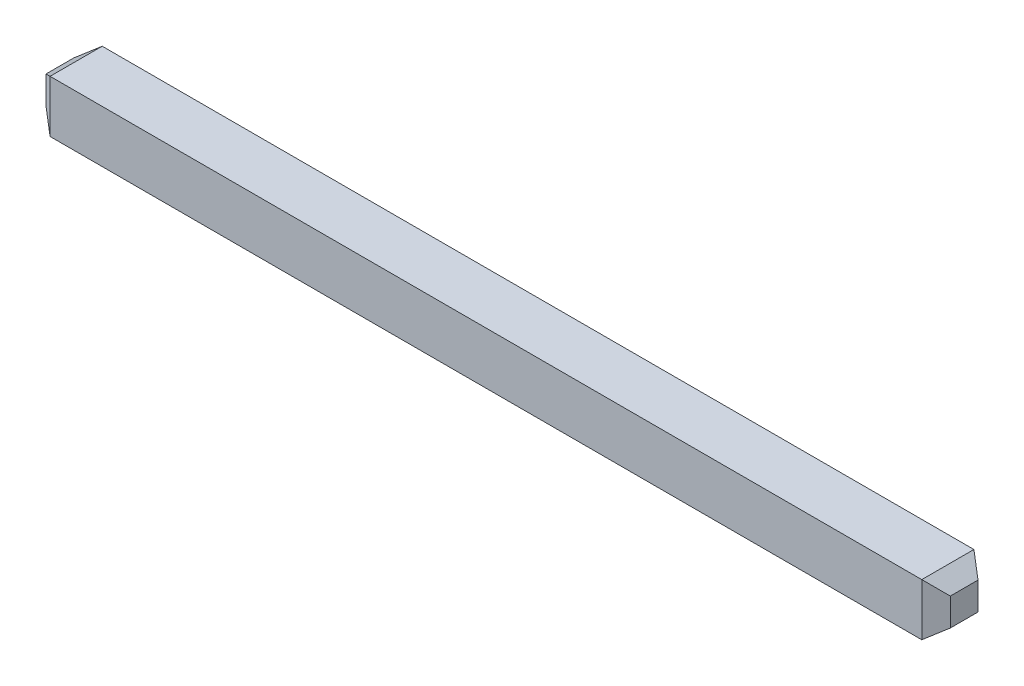
ISO-10303-21;
HEADER;
FILE_DESCRIPTION(('STEP AP214'),'2;1');
FILE_NAME('part.step','',(''),(''),'','','');
FILE_SCHEMA(('AUTOMOTIVE_DESIGN { 1 0 10303 214 1 1 1 1 }'));
ENDSEC;
DATA;
#1=APPLICATION_CONTEXT('core data for automotive mechanical design processes');
#2=APPLICATION_PROTOCOL_DEFINITION('international standard','automotive_design',2000,#1);
#3=PRODUCT_CONTEXT('',#1,'mechanical');
#4=PRODUCT('Part','Part','',(#3));
#5=PRODUCT_RELATED_PRODUCT_CATEGORY('part','',(#4));
#6=PRODUCT_DEFINITION_FORMATION('','',#4);
#7=PRODUCT_DEFINITION_CONTEXT('part definition',#1,'design');
#8=PRODUCT_DEFINITION('design','',#6,#7);
#9=PRODUCT_DEFINITION_SHAPE('','',#8);
#10=(LENGTH_UNIT() NAMED_UNIT(*) SI_UNIT(.MILLI.,.METRE.));
#11=(NAMED_UNIT(*) PLANE_ANGLE_UNIT() SI_UNIT($,.RADIAN.));
#12=(NAMED_UNIT(*) SI_UNIT($,.STERADIAN.) SOLID_ANGLE_UNIT());
#13=UNCERTAINTY_MEASURE_WITH_UNIT(LENGTH_MEASURE(1.E-05),#10,'distance_accuracy_value','');
#14=(GEOMETRIC_REPRESENTATION_CONTEXT(3) GLOBAL_UNCERTAINTY_ASSIGNED_CONTEXT((#13)) GLOBAL_UNIT_ASSIGNED_CONTEXT((#10,
#11,#12)) REPRESENTATION_CONTEXT('',''));
#15=CARTESIAN_POINT('',(0.,0.,0.));
#16=DIRECTION('',(0.,0.,1.));
#17=DIRECTION('',(1.,0.,0.));
#18=AXIS2_PLACEMENT_3D('',#15,#16,#17);
#19=CARTESIAN_POINT('',(-2.4,1.23,-44.695));
#20=DIRECTION('',(0.599999999990736,0.,0.800000000006948));
#21=DIRECTION('',(0.800000000006948,0.,-0.599999999990736));
#22=AXIS2_PLACEMENT_3D('',#19,#20,#21);
#23=PLANE('',#22);
#24=DIRECTION('',(0.,1.,0.));
#25=VECTOR('',#24,1.);
#26=CARTESIAN_POINT('',(-2.3,1.23,-44.77));
#27=LINE('',#26,#25);
#28=CARTESIAN_POINT('',(-2.29999999999956,1.55,-44.7699999999994));
#29=VERTEX_POINT('',#28);
#30=CARTESIAN_POINT('',(-2.29999999999957,0.909999999999898,-44.7699999999994));
#31=VERTEX_POINT('',#30);
#32=EDGE_CURVE('E101',#29,#31,#27,.F.);
#33=ORIENTED_EDGE('',*,*,#32,.T.);
#34=DIRECTION('',(-0.685994340569487,0.514495755428337,0.514495755427447));
#35=VECTOR('',#34,1.);
#36=CARTESIAN_POINT('',(-2.30000000000009,0.909999999999786,-44.77));
#37=LINE('',#36,#35);
#38=CARTESIAN_POINT('',(-2.50000000000021,1.06000000000001,-44.6200000000003));
#39=VERTEX_POINT('',#38);
#40=EDGE_CURVE('E85',#31,#39,#37,.T.);
#41=ORIENTED_EDGE('',*,*,#40,.T.);
#42=DIRECTION('',(0.,1.,0.));
#43=VECTOR('',#42,1.);
#44=CARTESIAN_POINT('',(-2.5,1.23,-44.62));
#45=LINE('',#44,#43);
#46=CARTESIAN_POINT('',(-2.50000000000043,1.4,-44.6200000000006));
#47=VERTEX_POINT('',#46);
#48=EDGE_CURVE('E79',#39,#47,#45,.T.);
#49=ORIENTED_EDGE('',*,*,#48,.T.);
#50=DIRECTION('',(-0.68599434057003,-0.514495755427523,0.514495755427537));
#51=VECTOR('',#50,1.);
#52=CARTESIAN_POINT('',(-2.3,1.55,-44.77));
#53=LINE('',#52,#51);
#54=EDGE_CURVE('E20',#29,#47,#53,.T.);
#55=ORIENTED_EDGE('',*,*,#54,.F.);
#56=EDGE_LOOP('',(#33,#41,#49,#55));
#57=FACE_BOUND('',#56,.T.);
#58=ADVANCED_FACE('F17',(#57),#23,.F.);
#59=CARTESIAN_POINT('',(8.5,1.23,-44.695));
#60=DIRECTION('',(-0.599999999990736,0.,0.800000000006948));
#61=DIRECTION('',(0.800000000006948,0.,0.599999999990736));
#62=AXIS2_PLACEMENT_3D('',#59,#60,#61);
#63=PLANE('',#62);
#64=DIRECTION('',(0.,1.,0.));
#65=VECTOR('',#64,1.);
#66=CARTESIAN_POINT('',(8.6,1.23,-44.62));
#67=LINE('',#66,#65);
#68=CARTESIAN_POINT('',(8.6000000000002,1.06000000000003,-44.6200000000003));
#69=VERTEX_POINT('',#68);
#70=CARTESIAN_POINT('',(8.60000000000043,1.4,-44.6200000000006));
#71=VERTEX_POINT('',#70);
#72=EDGE_CURVE('E113',#69,#71,#67,.T.);
#73=ORIENTED_EDGE('',*,*,#72,.F.);
#74=DIRECTION('',(-0.685994340569488,-0.514495755428337,-0.514495755427446));
#75=VECTOR('',#74,1.);
#76=CARTESIAN_POINT('',(8.59999999999996,1.06000000000005,-44.62));
#77=LINE('',#76,#75);
#78=CARTESIAN_POINT('',(8.39999999999958,0.909999999999884,-44.7699999999994));
#79=VERTEX_POINT('',#78);
#80=EDGE_CURVE('E108',#69,#79,#77,.T.);
#81=ORIENTED_EDGE('',*,*,#80,.T.);
#82=DIRECTION('',(0.,1.,0.));
#83=VECTOR('',#82,1.);
#84=CARTESIAN_POINT('',(8.4,1.23,-44.77));
#85=LINE('',#84,#83);
#86=CARTESIAN_POINT('',(8.39999999999956,1.55,-44.7699999999994));
#87=VERTEX_POINT('',#86);
#88=EDGE_CURVE('E99',#79,#87,#85,.T.);
#89=ORIENTED_EDGE('',*,*,#88,.T.);
#90=DIRECTION('',(-0.685994340570029,0.514495755427522,-0.51449575542754));
#91=VECTOR('',#90,1.);
#92=CARTESIAN_POINT('',(8.6,1.4,-44.62));
#93=LINE('',#92,#91);
#94=EDGE_CURVE('E116',#71,#87,#93,.T.);
#95=ORIENTED_EDGE('',*,*,#94,.F.);
#96=EDGE_LOOP('',(#73,#81,#89,#95));
#97=FACE_BOUND('',#96,.T.);
#98=ADVANCED_FACE('F214',(#97),#63,.F.);
#99=CARTESIAN_POINT('',(-2.4,1.475,-44.45));
#100=DIRECTION('',(-0.6,0.8,0.));
#101=DIRECTION('',(-0.8,-0.6,0.));
#102=AXIS2_PLACEMENT_3D('',#99,#100,#101);
#103=PLANE('',#102);
#104=DIRECTION('',(-0.685994340575993,-0.514495755427534,-0.514495755419575));
#105=VECTOR('',#104,1.);
#106=CARTESIAN_POINT('',(-2.29999999999913,1.55,-44.1300000000012));
#107=LINE('',#106,#105);
#108=CARTESIAN_POINT('',(-2.29999999999989,1.55,-44.1300000000002));
#109=VERTEX_POINT('',#108);
#110=CARTESIAN_POINT('',(-2.50000000000022,1.4,-44.2799999999997));
#111=VERTEX_POINT('',#110);
#112=EDGE_CURVE('E128',#109,#111,#107,.T.);
#113=ORIENTED_EDGE('',*,*,#112,.F.);
#114=DIRECTION('',(0.,0.,1.));
#115=VECTOR('',#114,1.);
#116=CARTESIAN_POINT('',(-2.3,1.55,-44.45));
#117=LINE('',#116,#115);
#118=EDGE_CURVE('E93',#29,#109,#117,.T.);
#119=ORIENTED_EDGE('',*,*,#118,.F.);
#120=ORIENTED_EDGE('',*,*,#54,.T.);
#121=DIRECTION('',(0.,0.,-1.));
#122=VECTOR('',#121,1.);
#123=CARTESIAN_POINT('',(-2.5,1.4,-44.45));
#124=LINE('',#123,#122);
#125=EDGE_CURVE('E87',#47,#111,#124,.F.);
#126=ORIENTED_EDGE('',*,*,#125,.T.);
#127=EDGE_LOOP('',(#113,#119,#120,#126));
#128=FACE_BOUND('',#127,.T.);
#129=ADVANCED_FACE('F90',(#128),#103,.T.);
#130=CARTESIAN_POINT('',(-2.5,1.23,-44.45));
#131=DIRECTION('',(1.,0.,0.));
#132=DIRECTION('',(0.,0.,-1.));
#133=AXIS2_PLACEMENT_3D('',#130,#131,#132);
#134=PLANE('',#133);
#135=DIRECTION('',(0.,1.,0.));
#136=VECTOR('',#135,1.);
#137=CARTESIAN_POINT('',(-2.50000000000087,1.23,-44.2799999999988));
#138=LINE('',#137,#136);
#139=CARTESIAN_POINT('',(-2.50000000000021,1.06000000000001,-44.2799999999997));
#140=VERTEX_POINT('',#139);
#141=EDGE_CURVE('E97',#111,#140,#138,.F.);
#142=ORIENTED_EDGE('',*,*,#141,.F.);
#143=ORIENTED_EDGE('',*,*,#125,.F.);
#144=ORIENTED_EDGE('',*,*,#48,.F.);
#145=DIRECTION('',(0.,0.,1.));
#146=VECTOR('',#145,1.);
#147=CARTESIAN_POINT('',(-2.49999999999996,1.06000000000005,-44.45));
#148=LINE('',#147,#146);
#149=EDGE_CURVE('E105',#39,#140,#148,.T.);
#150=ORIENTED_EDGE('',*,*,#149,.T.);
#151=EDGE_LOOP('',(#142,#143,#144,#150));
#152=FACE_BOUND('',#151,.T.);
#153=ADVANCED_FACE('F95',(#152),#134,.F.);
#154=CARTESIAN_POINT('',(3.05,1.23,-44.77));
#155=DIRECTION('',(0.,0.,1.));
#156=DIRECTION('',(1.,0.,0.));
#157=AXIS2_PLACEMENT_3D('',#154,#155,#156);
#158=PLANE('',#157);
#159=ORIENTED_EDGE('',*,*,#32,.F.);
#160=DIRECTION('',(1.,0.,0.));
#161=VECTOR('',#160,1.);
#162=CARTESIAN_POINT('',(3.05,1.55,-44.77));
#163=LINE('',#162,#161);
#164=EDGE_CURVE('E122',#87,#29,#163,.F.);
#165=ORIENTED_EDGE('',*,*,#164,.F.);
#166=ORIENTED_EDGE('',*,*,#88,.F.);
#167=DIRECTION('',(1.,0.,0.));
#168=VECTOR('',#167,1.);
#169=CARTESIAN_POINT('',(3.05,0.91,-44.77));
#170=LINE('',#169,#168);
#171=EDGE_CURVE('E136',#79,#31,#170,.F.);
#172=ORIENTED_EDGE('',*,*,#171,.T.);
#173=EDGE_LOOP('',(#159,#165,#166,#172));
#174=FACE_BOUND('',#173,.T.);
#175=ADVANCED_FACE('F182',(#174),#158,.F.);
#176=CARTESIAN_POINT('',(-2.4,0.9849999999999,-44.45));
#177=DIRECTION('',(0.600000000000912,0.799999999999316,0.));
#178=DIRECTION('',(-0.799999999999316,0.600000000000912,0.));
#179=AXIS2_PLACEMENT_3D('',#176,#177,#178);
#180=PLANE('',#179);
#181=DIRECTION('',(0.,0.,1.));
#182=VECTOR('',#181,1.);
#183=CARTESIAN_POINT('',(-2.3,0.91,-44.45));
#184=LINE('',#183,#182);
#185=CARTESIAN_POINT('',(-2.29999999999983,0.909999999999856,-44.1300000000003));
#186=VERTEX_POINT('',#185);
#187=EDGE_CURVE('E139',#31,#186,#184,.T.);
#188=ORIENTED_EDGE('',*,*,#187,.T.);
#189=DIRECTION('',(0.685994340575871,-0.514495755427787,0.514495755419485));
#190=VECTOR('',#189,1.);
#191=CARTESIAN_POINT('',(-2.50000000000087,1.06,-44.2799999999988));
#192=LINE('',#191,#190);
#193=EDGE_CURVE('E131',#140,#186,#192,.T.);
#194=ORIENTED_EDGE('',*,*,#193,.F.);
#195=ORIENTED_EDGE('',*,*,#149,.F.);
#196=ORIENTED_EDGE('',*,*,#40,.F.);
#197=EDGE_LOOP('',(#188,#194,#195,#196));
#198=FACE_BOUND('',#197,.T.);
#199=ADVANCED_FACE('F179',(#198),#180,.F.);
#200=CARTESIAN_POINT('',(8.5,0.9849999999999,-44.45));
#201=DIRECTION('',(-0.600000000000912,0.799999999999316,0.));
#202=DIRECTION('',(-0.799999999999316,-0.600000000000912,0.));
#203=AXIS2_PLACEMENT_3D('',#200,#201,#202);
#204=PLANE('',#203);
#205=DIRECTION('',(0.,0.,-1.));
#206=VECTOR('',#205,1.);
#207=CARTESIAN_POINT('',(8.6,1.06,-44.45));
#208=LINE('',#207,#206);
#209=CARTESIAN_POINT('',(8.6000000000002,1.06000000000003,-44.2799999999997));
#210=VERTEX_POINT('',#209);
#211=EDGE_CURVE('E110',#210,#69,#208,.T.);
#212=ORIENTED_EDGE('',*,*,#211,.F.);
#213=DIRECTION('',(0.685994340575871,0.514495755427787,-0.514495755419485));
#214=VECTOR('',#213,1.);
#215=CARTESIAN_POINT('',(8.39999999999913,0.9099999999999,-44.1300000000012));
#216=LINE('',#215,#214);
#217=CARTESIAN_POINT('',(8.39999999999993,0.909999999999868,-44.1300000000002));
#218=VERTEX_POINT('',#217);
#219=EDGE_CURVE('E35',#218,#210,#216,.T.);
#220=ORIENTED_EDGE('',*,*,#219,.F.);
#221=DIRECTION('',(0.,0.,1.));
#222=VECTOR('',#221,1.);
#223=CARTESIAN_POINT('',(8.4,0.91,-44.45));
#224=LINE('',#223,#222);
#225=EDGE_CURVE('E134',#218,#79,#224,.F.);
#226=ORIENTED_EDGE('',*,*,#225,.T.);
#227=ORIENTED_EDGE('',*,*,#80,.F.);
#228=EDGE_LOOP('',(#212,#220,#226,#227));
#229=FACE_BOUND('',#228,.T.);
#230=ADVANCED_FACE('F181',(#229),#204,.F.);
#231=CARTESIAN_POINT('',(8.6,1.23,-44.45));
#232=DIRECTION('',(1.,0.,0.));
#233=DIRECTION('',(0.,0.,-1.));
#234=AXIS2_PLACEMENT_3D('',#231,#232,#233);
#235=PLANE('',#234);
#236=ORIENTED_EDGE('',*,*,#72,.T.);
#237=DIRECTION('',(0.,0.,1.));
#238=VECTOR('',#237,1.);
#239=CARTESIAN_POINT('',(8.6,1.4,-44.45));
#240=LINE('',#239,#238);
#241=CARTESIAN_POINT('',(8.60000000000022,1.4,-44.2799999999997));
#242=VERTEX_POINT('',#241);
#243=EDGE_CURVE('E119',#242,#71,#240,.F.);
#244=ORIENTED_EDGE('',*,*,#243,.F.);
#245=DIRECTION('',(0.,1.,0.));
#246=VECTOR('',#245,1.);
#247=CARTESIAN_POINT('',(8.60000000000087,1.23,-44.2799999999988));
#248=LINE('',#247,#246);
#249=EDGE_CURVE('E142',#210,#242,#248,.T.);
#250=ORIENTED_EDGE('',*,*,#249,.F.);
#251=ORIENTED_EDGE('',*,*,#211,.T.);
#252=EDGE_LOOP('',(#236,#244,#250,#251));
#253=FACE_BOUND('',#252,.T.);
#254=ADVANCED_FACE('F189',(#253),#235,.T.);
#255=CARTESIAN_POINT('',(8.5,1.475,-44.45));
#256=DIRECTION('',(0.6,0.8,0.));
#257=DIRECTION('',(-0.8,0.6,0.));
#258=AXIS2_PLACEMENT_3D('',#255,#256,#257);
#259=PLANE('',#258);
#260=DIRECTION('',(-0.685994340575992,0.514495755427535,0.514495755419576));
#261=VECTOR('',#260,1.);
#262=CARTESIAN_POINT('',(8.60000000000087,1.4,-44.2799999999988));
#263=LINE('',#262,#261);
#264=CARTESIAN_POINT('',(8.39999999999989,1.55,-44.1300000000002));
#265=VERTEX_POINT('',#264);
#266=EDGE_CURVE('E145',#242,#265,#263,.T.);
#267=ORIENTED_EDGE('',*,*,#266,.F.);
#268=ORIENTED_EDGE('',*,*,#243,.T.);
#269=ORIENTED_EDGE('',*,*,#94,.T.);
#270=DIRECTION('',(0.,0.,1.));
#271=VECTOR('',#270,1.);
#272=CARTESIAN_POINT('',(8.4,1.55,-44.45));
#273=LINE('',#272,#271);
#274=EDGE_CURVE('E125',#265,#87,#273,.F.);
#275=ORIENTED_EDGE('',*,*,#274,.F.);
#276=EDGE_LOOP('',(#267,#268,#269,#275));
#277=FACE_BOUND('',#276,.T.);
#278=ADVANCED_FACE('F170',(#277),#259,.T.);
#279=CARTESIAN_POINT('',(3.05,1.55,-44.45));
#280=DIRECTION('',(0.,1.,0.));
#281=DIRECTION('',(0.,0.,1.));
#282=AXIS2_PLACEMENT_3D('',#279,#280,#281);
#283=PLANE('',#282);
#284=DIRECTION('',(1.,0.,0.));
#285=VECTOR('',#284,1.);
#286=CARTESIAN_POINT('',(3.05,1.55,-44.13));
#287=LINE('',#286,#285);
#288=EDGE_CURVE('E148',#265,#109,#287,.F.);
#289=ORIENTED_EDGE('',*,*,#288,.F.);
#290=ORIENTED_EDGE('',*,*,#274,.T.);
#291=ORIENTED_EDGE('',*,*,#164,.T.);
#292=ORIENTED_EDGE('',*,*,#118,.T.);
#293=EDGE_LOOP('',(#289,#290,#291,#292));
#294=FACE_BOUND('',#293,.T.);
#295=ADVANCED_FACE('F173',(#294),#283,.T.);
#296=CARTESIAN_POINT('',(-2.4,1.23,-44.205));
#297=DIRECTION('',(-0.599999999990736,0.,0.800000000006948));
#298=DIRECTION('',(0.800000000006948,0.,0.599999999990736));
#299=AXIS2_PLACEMENT_3D('',#296,#297,#298);
#300=PLANE('',#299);
#301=ORIENTED_EDGE('',*,*,#193,.T.);
#302=DIRECTION('',(0.,1.,0.));
#303=VECTOR('',#302,1.);
#304=CARTESIAN_POINT('',(-2.3,1.23,-44.13));
#305=LINE('',#304,#303);
#306=EDGE_CURVE('E151',#109,#186,#305,.F.);
#307=ORIENTED_EDGE('',*,*,#306,.F.);
#308=ORIENTED_EDGE('',*,*,#112,.T.);
#309=ORIENTED_EDGE('',*,*,#141,.T.);
#310=EDGE_LOOP('',(#301,#307,#308,#309));
#311=FACE_BOUND('',#310,.T.);
#312=ADVANCED_FACE('F176',(#311),#300,.T.);
#313=CARTESIAN_POINT('',(3.05,0.91,-44.45));
#314=DIRECTION('',(0.,1.,0.));
#315=DIRECTION('',(0.,0.,1.));
#316=AXIS2_PLACEMENT_3D('',#313,#314,#315);
#317=PLANE('',#316);
#318=ORIENTED_EDGE('',*,*,#187,.F.);
#319=ORIENTED_EDGE('',*,*,#171,.F.);
#320=ORIENTED_EDGE('',*,*,#225,.F.);
#321=DIRECTION('',(1.,0.,0.));
#322=VECTOR('',#321,1.);
#323=CARTESIAN_POINT('',(3.05,0.9099999999999,-44.13));
#324=LINE('',#323,#322);
#325=EDGE_CURVE('E26',#186,#218,#324,.T.);
#326=ORIENTED_EDGE('',*,*,#325,.F.);
#327=EDGE_LOOP('',(#318,#319,#320,#326));
#328=FACE_BOUND('',#327,.T.);
#329=ADVANCED_FACE('F162',(#328),#317,.F.);
#330=CARTESIAN_POINT('',(8.5,1.23,-44.205));
#331=DIRECTION('',(0.599999999990736,0.,0.800000000006948));
#332=DIRECTION('',(0.800000000006948,0.,-0.599999999990736));
#333=AXIS2_PLACEMENT_3D('',#330,#331,#332);
#334=PLANE('',#333);
#335=ORIENTED_EDGE('',*,*,#266,.T.);
#336=DIRECTION('',(0.,1.,0.));
#337=VECTOR('',#336,1.);
#338=CARTESIAN_POINT('',(8.4,1.23,-44.13));
#339=LINE('',#338,#337);
#340=EDGE_CURVE('E11',#218,#265,#339,.T.);
#341=ORIENTED_EDGE('',*,*,#340,.F.);
#342=ORIENTED_EDGE('',*,*,#219,.T.);
#343=ORIENTED_EDGE('',*,*,#249,.T.);
#344=EDGE_LOOP('',(#335,#341,#342,#343));
#345=FACE_BOUND('',#344,.T.);
#346=ADVANCED_FACE('F166',(#345),#334,.T.);
#347=CARTESIAN_POINT('',(3.05,1.23,-44.13));
#348=DIRECTION('',(0.,0.,1.));
#349=DIRECTION('',(1.,0.,0.));
#350=AXIS2_PLACEMENT_3D('',#347,#348,#349);
#351=PLANE('',#350);
#352=ORIENTED_EDGE('',*,*,#325,.T.);
#353=ORIENTED_EDGE('',*,*,#340,.T.);
#354=ORIENTED_EDGE('',*,*,#288,.T.);
#355=ORIENTED_EDGE('',*,*,#306,.T.);
#356=EDGE_LOOP('',(#352,#353,#354,#355));
#357=FACE_BOUND('',#356,.T.);
#358=ADVANCED_FACE('F157',(#357),#351,.T.);
#359=CLOSED_SHELL('',(#58,#98,#129,#153,#175,#199,#230,#254,#278,#295,#312,#329,#346,#358));
#360=MANIFOLD_SOLID_BREP('B1',#359);
#361=ADVANCED_BREP_SHAPE_REPRESENTATION('',(#18,#360),#14);
#362=SHAPE_DEFINITION_REPRESENTATION(#9,#361);
ENDSEC;
END-ISO-10303-21;
